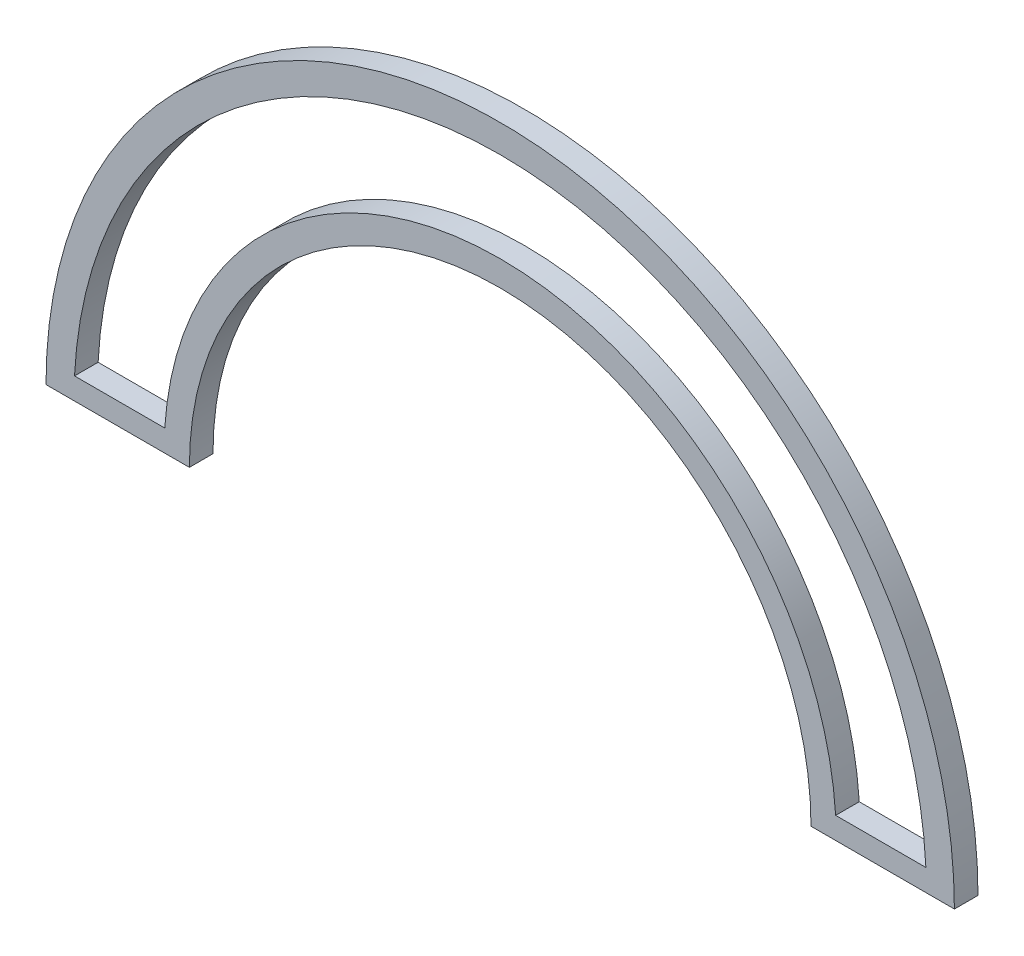
ISO-10303-21;
HEADER;
FILE_DESCRIPTION(('STEP AP214'),'2;1');
FILE_NAME('part.step','',(''),(''),'','','');
FILE_SCHEMA(('AUTOMOTIVE_DESIGN { 1 0 10303 214 1 1 1 1 }'));
ENDSEC;
DATA;
#1=APPLICATION_CONTEXT('core data for automotive mechanical design processes');
#2=APPLICATION_PROTOCOL_DEFINITION('international standard','automotive_design',2000,#1);
#3=PRODUCT_CONTEXT('',#1,'mechanical');
#4=PRODUCT('Part','Part','',(#3));
#5=PRODUCT_RELATED_PRODUCT_CATEGORY('part','',(#4));
#6=PRODUCT_DEFINITION_FORMATION('','',#4);
#7=PRODUCT_DEFINITION_CONTEXT('part definition',#1,'design');
#8=PRODUCT_DEFINITION('design','',#6,#7);
#9=PRODUCT_DEFINITION_SHAPE('','',#8);
#10=(LENGTH_UNIT() NAMED_UNIT(*) SI_UNIT(.MILLI.,.METRE.));
#11=(NAMED_UNIT(*) PLANE_ANGLE_UNIT() SI_UNIT($,.RADIAN.));
#12=(NAMED_UNIT(*) SI_UNIT($,.STERADIAN.) SOLID_ANGLE_UNIT());
#13=UNCERTAINTY_MEASURE_WITH_UNIT(LENGTH_MEASURE(1.E-05),#10,'distance_accuracy_value','');
#14=(GEOMETRIC_REPRESENTATION_CONTEXT(3) GLOBAL_UNCERTAINTY_ASSIGNED_CONTEXT((#13)) GLOBAL_UNIT_ASSIGNED_CONTEXT((#10,
#11,#12)) REPRESENTATION_CONTEXT('',''));
#15=CARTESIAN_POINT('',(0.,0.,0.));
#16=DIRECTION('',(0.,0.,1.));
#17=DIRECTION('',(1.,0.,0.));
#18=AXIS2_PLACEMENT_3D('',#15,#16,#17);
#19=CARTESIAN_POINT('',(0.,0.,5.));
#20=DIRECTION('',(0.,0.,1.));
#21=DIRECTION('',(1.,0.,0.));
#22=AXIS2_PLACEMENT_3D('',#19,#20,#21);
#23=PLANE('',#22);
#24=CARTESIAN_POINT('',(0.,0.,5.));
#25=DIRECTION('',(0.,0.,1.));
#26=DIRECTION('',(1.,0.,0.));
#27=AXIS2_PLACEMENT_3D('',#24,#25,#26);
#28=CIRCLE('',#27,96.2196475749016);
#29=CARTESIAN_POINT('',(96.2196475749016,0.,5.));
#30=VERTEX_POINT('',#29);
#31=CARTESIAN_POINT('',(-96.2196475749016,0.,5.));
#32=VERTEX_POINT('',#31);
#33=EDGE_CURVE('E133',#30,#32,#28,.T.);
#34=ORIENTED_EDGE('',*,*,#33,.T.);
#35=DIRECTION('',(1.,0.,0.));
#36=VECTOR('',#35,1.);
#37=CARTESIAN_POINT('',(-96.2196475749016,0.,5.));
#38=LINE('',#37,#36);
#39=CARTESIAN_POINT('',(-65.8460779680655,0.,5.));
#40=VERTEX_POINT('',#39);
#41=EDGE_CURVE('E136',#32,#40,#38,.T.);
#42=ORIENTED_EDGE('',*,*,#41,.T.);
#43=CARTESIAN_POINT('',(0.,0.,5.));
#44=DIRECTION('',(0.,0.,-1.));
#45=DIRECTION('',(1.,0.,0.));
#46=AXIS2_PLACEMENT_3D('',#43,#44,#45);
#47=CIRCLE('',#46,65.8460779680655);
#48=CARTESIAN_POINT('',(65.8460779680655,0.,5.));
#49=VERTEX_POINT('',#48);
#50=EDGE_CURVE('E139',#40,#49,#47,.T.);
#51=ORIENTED_EDGE('',*,*,#50,.T.);
#52=DIRECTION('',(1.,0.,0.));
#53=VECTOR('',#52,1.);
#54=CARTESIAN_POINT('',(65.8460779680655,0.,5.));
#55=LINE('',#54,#53);
#56=EDGE_CURVE('E141',#49,#30,#55,.T.);
#57=ORIENTED_EDGE('',*,*,#56,.T.);
#58=EDGE_LOOP('',(#34,#42,#51,#57));
#59=FACE_BOUND('',#58,.T.);
#60=DIRECTION('',(1.,0.,0.));
#61=VECTOR('',#60,1.);
#62=CARTESIAN_POINT('',(-90.1814911941664,4.61076413342446,5.));
#63=LINE('',#62,#61);
#64=CARTESIAN_POINT('',(-90.1814911941664,4.61076413342446,5.));
#65=VERTEX_POINT('',#64);
#66=CARTESIAN_POINT('',(-71.0625299745735,4.61076413342446,5.));
#67=VERTEX_POINT('',#66);
#68=EDGE_CURVE('E105',#65,#67,#63,.T.);
#69=ORIENTED_EDGE('',*,*,#68,.F.);
#70=CARTESIAN_POINT('',(0.,0.,5.));
#71=DIRECTION('',(0.,0.,1.));
#72=DIRECTION('',(1.,0.,0.));
#73=AXIS2_PLACEMENT_3D('',#70,#71,#72);
#74=CIRCLE('',#73,90.2992829423223);
#75=CARTESIAN_POINT('',(90.1814911941664,4.61076413342446,5.));
#76=VERTEX_POINT('',#75);
#77=EDGE_CURVE('E97',#76,#65,#74,.T.);
#78=ORIENTED_EDGE('',*,*,#77,.F.);
#79=DIRECTION('',(1.,0.,0.));
#80=VECTOR('',#79,1.);
#81=CARTESIAN_POINT('',(71.0625299745735,4.61076413342446,5.));
#82=LINE('',#81,#80);
#83=CARTESIAN_POINT('',(71.0625299745735,4.61076413342446,5.));
#84=VERTEX_POINT('',#83);
#85=EDGE_CURVE('E119',#84,#76,#82,.T.);
#86=ORIENTED_EDGE('',*,*,#85,.F.);
#87=CARTESIAN_POINT('',(0.,0.,5.));
#88=DIRECTION('',(0.,0.,-1.));
#89=DIRECTION('',(1.,0.,0.));
#90=AXIS2_PLACEMENT_3D('',#87,#88,#89);
#91=CIRCLE('',#90,71.2119534367737);
#92=EDGE_CURVE('E117',#67,#84,#91,.T.);
#93=ORIENTED_EDGE('',*,*,#92,.F.);
#94=EDGE_LOOP('',(#69,#78,#86,#93));
#95=FACE_BOUND('',#94,.T.);
#96=ADVANCED_FACE('F32',(#59,#95),#23,.T.);
#97=CARTESIAN_POINT('',(0.,0.,0.));
#98=DIRECTION('',(0.,0.,1.));
#99=DIRECTION('',(1.,0.,0.));
#100=AXIS2_PLACEMENT_3D('',#97,#98,#99);
#101=PLANE('',#100);
#102=CARTESIAN_POINT('',(0.,0.,0.));
#103=DIRECTION('',(0.,0.,1.));
#104=DIRECTION('',(1.,0.,0.));
#105=AXIS2_PLACEMENT_3D('',#102,#103,#104);
#106=CIRCLE('',#105,96.2196475749016);
#107=CARTESIAN_POINT('',(96.2196475749016,0.,0.));
#108=VERTEX_POINT('',#107);
#109=CARTESIAN_POINT('',(-96.2196475749016,0.,0.));
#110=VERTEX_POINT('',#109);
#111=EDGE_CURVE('E113',#108,#110,#106,.T.);
#112=ORIENTED_EDGE('',*,*,#111,.F.);
#113=DIRECTION('',(1.,0.,0.));
#114=VECTOR('',#113,1.);
#115=CARTESIAN_POINT('',(65.8460779680655,0.,0.));
#116=LINE('',#115,#114);
#117=CARTESIAN_POINT('',(65.8460779680655,0.,0.));
#118=VERTEX_POINT('',#117);
#119=EDGE_CURVE('E137',#118,#108,#116,.T.);
#120=ORIENTED_EDGE('',*,*,#119,.F.);
#121=CARTESIAN_POINT('',(0.,0.,0.));
#122=DIRECTION('',(0.,0.,-1.));
#123=DIRECTION('',(1.,0.,0.));
#124=AXIS2_PLACEMENT_3D('',#121,#122,#123);
#125=CIRCLE('',#124,65.8460779680655);
#126=CARTESIAN_POINT('',(-65.8460779680655,0.,0.));
#127=VERTEX_POINT('',#126);
#128=EDGE_CURVE('E148',#127,#118,#125,.T.);
#129=ORIENTED_EDGE('',*,*,#128,.F.);
#130=DIRECTION('',(1.,0.,0.));
#131=VECTOR('',#130,1.);
#132=CARTESIAN_POINT('',(-96.2196475749016,0.,0.));
#133=LINE('',#132,#131);
#134=EDGE_CURVE('E146',#110,#127,#133,.T.);
#135=ORIENTED_EDGE('',*,*,#134,.F.);
#136=EDGE_LOOP('',(#112,#120,#129,#135));
#137=FACE_BOUND('',#136,.T.);
#138=CARTESIAN_POINT('',(0.,0.,0.));
#139=DIRECTION('',(0.,0.,1.));
#140=DIRECTION('',(1.,0.,0.));
#141=AXIS2_PLACEMENT_3D('',#138,#139,#140);
#142=CIRCLE('',#141,90.2992829423223);
#143=CARTESIAN_POINT('',(90.1814911941664,4.61076413342446,0.));
#144=VERTEX_POINT('',#143);
#145=CARTESIAN_POINT('',(-90.1814911941664,4.61076413342446,0.));
#146=VERTEX_POINT('',#145);
#147=EDGE_CURVE('E55',#144,#146,#142,.T.);
#148=ORIENTED_EDGE('',*,*,#147,.T.);
#149=DIRECTION('',(1.,0.,0.));
#150=VECTOR('',#149,1.);
#151=CARTESIAN_POINT('',(-90.1814911941664,4.61076413342446,0.));
#152=LINE('',#151,#150);
#153=CARTESIAN_POINT('',(-71.0625299745735,4.61076413342446,0.));
#154=VERTEX_POINT('',#153);
#155=EDGE_CURVE('E112',#146,#154,#152,.T.);
#156=ORIENTED_EDGE('',*,*,#155,.T.);
#157=CARTESIAN_POINT('',(0.,0.,0.));
#158=DIRECTION('',(0.,0.,-1.));
#159=DIRECTION('',(1.,0.,0.));
#160=AXIS2_PLACEMENT_3D('',#157,#158,#159);
#161=CIRCLE('',#160,71.2119534367737);
#162=CARTESIAN_POINT('',(71.0625299745735,4.61076413342446,0.));
#163=VERTEX_POINT('',#162);
#164=EDGE_CURVE('E125',#154,#163,#161,.T.);
#165=ORIENTED_EDGE('',*,*,#164,.T.);
#166=DIRECTION('',(1.,0.,0.));
#167=VECTOR('',#166,1.);
#168=CARTESIAN_POINT('',(71.0625299745735,4.61076413342446,0.));
#169=LINE('',#168,#167);
#170=EDGE_CURVE('E106',#163,#144,#169,.T.);
#171=ORIENTED_EDGE('',*,*,#170,.T.);
#172=EDGE_LOOP('',(#148,#156,#165,#171));
#173=FACE_BOUND('',#172,.T.);
#174=ADVANCED_FACE('F166',(#137,#173),#101,.F.);
#175=CARTESIAN_POINT('',(0.,0.,5.));
#176=DIRECTION('',(0.,0.,-1.));
#177=DIRECTION('',(-1.,0.,0.));
#178=AXIS2_PLACEMENT_3D('',#175,#176,#177);
#179=CYLINDRICAL_SURFACE('',#178,96.2196475749016);
#180=ORIENTED_EDGE('',*,*,#111,.T.);
#181=DIRECTION('',(0.,0.,-1.));
#182=VECTOR('',#181,1.);
#183=CARTESIAN_POINT('',(-96.2196475749016,0.,5.));
#184=LINE('',#183,#182);
#185=EDGE_CURVE('E11',#32,#110,#184,.T.);
#186=ORIENTED_EDGE('',*,*,#185,.F.);
#187=ORIENTED_EDGE('',*,*,#33,.F.);
#188=DIRECTION('',(0.,0.,-1.));
#189=VECTOR('',#188,1.);
#190=CARTESIAN_POINT('',(96.2196475749016,0.,5.));
#191=LINE('',#190,#189);
#192=EDGE_CURVE('E143',#30,#108,#191,.T.);
#193=ORIENTED_EDGE('',*,*,#192,.T.);
#194=EDGE_LOOP('',(#180,#186,#187,#193));
#195=FACE_BOUND('',#194,.T.);
#196=ADVANCED_FACE('F34',(#195),#179,.T.);
#197=CARTESIAN_POINT('',(-96.2196475749016,0.,5.));
#198=DIRECTION('',(0.,1.,0.));
#199=DIRECTION('',(0.,0.,1.));
#200=AXIS2_PLACEMENT_3D('',#197,#198,#199);
#201=PLANE('',#200);
#202=ORIENTED_EDGE('',*,*,#134,.T.);
#203=DIRECTION('',(0.,0.,-1.));
#204=VECTOR('',#203,1.);
#205=CARTESIAN_POINT('',(-65.8460779680655,0.,5.));
#206=LINE('',#205,#204);
#207=EDGE_CURVE('E40',#40,#127,#206,.T.);
#208=ORIENTED_EDGE('',*,*,#207,.F.);
#209=ORIENTED_EDGE('',*,*,#41,.F.);
#210=ORIENTED_EDGE('',*,*,#185,.T.);
#211=EDGE_LOOP('',(#202,#208,#209,#210));
#212=FACE_BOUND('',#211,.T.);
#213=ADVANCED_FACE('F176',(#212),#201,.F.);
#214=CARTESIAN_POINT('',(0.,0.,5.));
#215=DIRECTION('',(0.,0.,-1.));
#216=DIRECTION('',(-1.,0.,0.));
#217=AXIS2_PLACEMENT_3D('',#214,#215,#216);
#218=CYLINDRICAL_SURFACE('',#217,65.8460779680655);
#219=ORIENTED_EDGE('',*,*,#128,.T.);
#220=DIRECTION('',(0.,0.,-1.));
#221=VECTOR('',#220,1.);
#222=CARTESIAN_POINT('',(65.8460779680655,0.,5.));
#223=LINE('',#222,#221);
#224=EDGE_CURVE('E153',#49,#118,#223,.T.);
#225=ORIENTED_EDGE('',*,*,#224,.F.);
#226=ORIENTED_EDGE('',*,*,#50,.F.);
#227=ORIENTED_EDGE('',*,*,#207,.T.);
#228=EDGE_LOOP('',(#219,#225,#226,#227));
#229=FACE_BOUND('',#228,.T.);
#230=ADVANCED_FACE('F160',(#229),#218,.F.);
#231=CARTESIAN_POINT('',(65.8460779680655,0.,5.));
#232=DIRECTION('',(0.,1.,0.));
#233=DIRECTION('',(0.,0.,1.));
#234=AXIS2_PLACEMENT_3D('',#231,#232,#233);
#235=PLANE('',#234);
#236=ORIENTED_EDGE('',*,*,#119,.T.);
#237=ORIENTED_EDGE('',*,*,#192,.F.);
#238=ORIENTED_EDGE('',*,*,#56,.F.);
#239=ORIENTED_EDGE('',*,*,#224,.T.);
#240=EDGE_LOOP('',(#236,#237,#238,#239));
#241=FACE_BOUND('',#240,.T.);
#242=ADVANCED_FACE('F170',(#241),#235,.F.);
#243=CARTESIAN_POINT('',(0.,0.,5.));
#244=DIRECTION('',(0.,0.,-1.));
#245=DIRECTION('',(-1.,0.,0.));
#246=AXIS2_PLACEMENT_3D('',#243,#244,#245);
#247=CYLINDRICAL_SURFACE('',#246,90.2992829423223);
#248=ORIENTED_EDGE('',*,*,#147,.F.);
#249=DIRECTION('',(0.,0.,-1.));
#250=VECTOR('',#249,1.);
#251=CARTESIAN_POINT('',(90.1814911941664,4.61076413342446,5.));
#252=LINE('',#251,#250);
#253=EDGE_CURVE('E101',#76,#144,#252,.T.);
#254=ORIENTED_EDGE('',*,*,#253,.F.);
#255=ORIENTED_EDGE('',*,*,#77,.T.);
#256=DIRECTION('',(0.,0.,-1.));
#257=VECTOR('',#256,1.);
#258=CARTESIAN_POINT('',(-90.1814911941664,4.61076413342446,5.));
#259=LINE('',#258,#257);
#260=EDGE_CURVE('E100',#65,#146,#259,.T.);
#261=ORIENTED_EDGE('',*,*,#260,.T.);
#262=EDGE_LOOP('',(#248,#254,#255,#261));
#263=FACE_BOUND('',#262,.T.);
#264=ADVANCED_FACE('F99',(#263),#247,.F.);
#265=CARTESIAN_POINT('',(-90.1814911941664,4.61076413342446,5.));
#266=DIRECTION('',(0.,1.,0.));
#267=DIRECTION('',(0.,0.,1.));
#268=AXIS2_PLACEMENT_3D('',#265,#266,#267);
#269=PLANE('',#268);
#270=ORIENTED_EDGE('',*,*,#155,.F.);
#271=ORIENTED_EDGE('',*,*,#260,.F.);
#272=ORIENTED_EDGE('',*,*,#68,.T.);
#273=DIRECTION('',(0.,0.,-1.));
#274=VECTOR('',#273,1.);
#275=CARTESIAN_POINT('',(-71.0625299745735,4.61076413342446,5.));
#276=LINE('',#275,#274);
#277=EDGE_CURVE('E114',#67,#154,#276,.T.);
#278=ORIENTED_EDGE('',*,*,#277,.T.);
#279=EDGE_LOOP('',(#270,#271,#272,#278));
#280=FACE_BOUND('',#279,.T.);
#281=ADVANCED_FACE('F109',(#280),#269,.T.);
#282=CARTESIAN_POINT('',(0.,0.,5.));
#283=DIRECTION('',(0.,0.,-1.));
#284=DIRECTION('',(-1.,0.,0.));
#285=AXIS2_PLACEMENT_3D('',#282,#283,#284);
#286=CYLINDRICAL_SURFACE('',#285,71.2119534367737);
#287=ORIENTED_EDGE('',*,*,#164,.F.);
#288=ORIENTED_EDGE('',*,*,#277,.F.);
#289=ORIENTED_EDGE('',*,*,#92,.T.);
#290=DIRECTION('',(0.,0.,-1.));
#291=VECTOR('',#290,1.);
#292=CARTESIAN_POINT('',(71.0625299745735,4.61076413342446,5.));
#293=LINE('',#292,#291);
#294=EDGE_CURVE('E47',#84,#163,#293,.T.);
#295=ORIENTED_EDGE('',*,*,#294,.T.);
#296=EDGE_LOOP('',(#287,#288,#289,#295));
#297=FACE_BOUND('',#296,.T.);
#298=ADVANCED_FACE('F199',(#297),#286,.T.);
#299=CARTESIAN_POINT('',(71.0625299745735,4.61076413342446,5.));
#300=DIRECTION('',(0.,1.,0.));
#301=DIRECTION('',(0.,0.,1.));
#302=AXIS2_PLACEMENT_3D('',#299,#300,#301);
#303=PLANE('',#302);
#304=ORIENTED_EDGE('',*,*,#170,.F.);
#305=ORIENTED_EDGE('',*,*,#294,.F.);
#306=ORIENTED_EDGE('',*,*,#85,.T.);
#307=ORIENTED_EDGE('',*,*,#253,.T.);
#308=EDGE_LOOP('',(#304,#305,#306,#307));
#309=FACE_BOUND('',#308,.T.);
#310=ADVANCED_FACE('F203',(#309),#303,.T.);
#311=CLOSED_SHELL('',(#96,#174,#196,#213,#230,#242,#264,#281,#298,#310));
#312=MANIFOLD_SOLID_BREP('B2',#311);
#313=ADVANCED_BREP_SHAPE_REPRESENTATION('',(#18,#312),#14);
#314=SHAPE_DEFINITION_REPRESENTATION(#9,#313);
ENDSEC;
END-ISO-10303-21;
